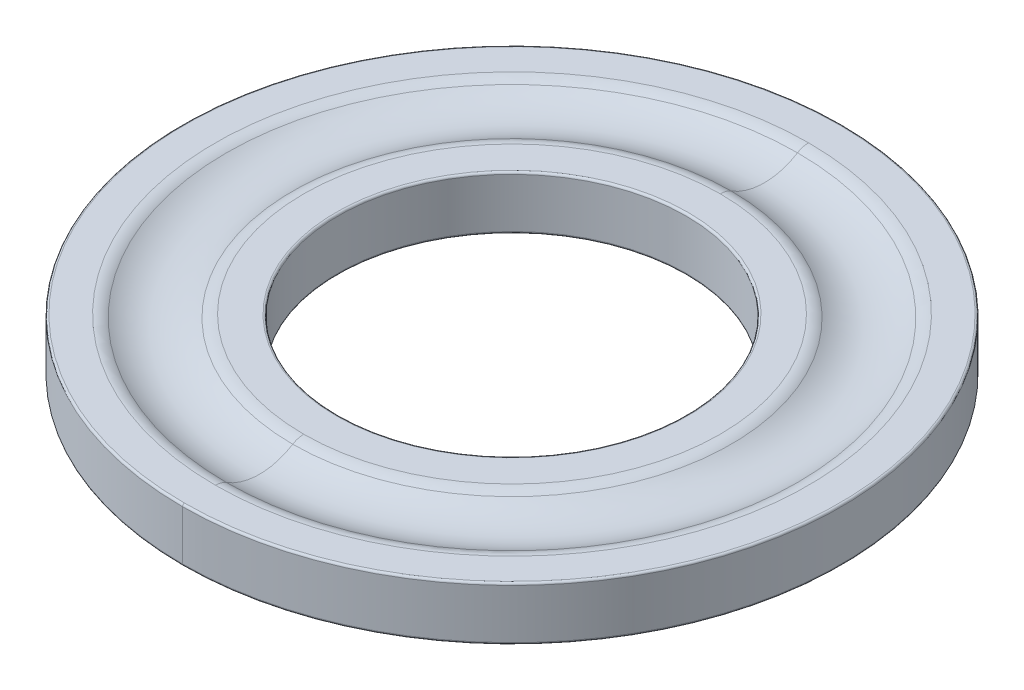
ISO-10303-21;
HEADER;
FILE_DESCRIPTION(('STEP AP214'),'2;1');
FILE_NAME('part.step','',(''),(''),'','','');
FILE_SCHEMA(('AUTOMOTIVE_DESIGN { 1 0 10303 214 1 1 1 1 }'));
ENDSEC;
DATA;
#1=APPLICATION_CONTEXT('core data for automotive mechanical design processes');
#2=APPLICATION_PROTOCOL_DEFINITION('international standard','automotive_design',2000,#1);
#3=PRODUCT_CONTEXT('',#1,'mechanical');
#4=PRODUCT('Part','Part','',(#3));
#5=PRODUCT_RELATED_PRODUCT_CATEGORY('part','',(#4));
#6=PRODUCT_DEFINITION_FORMATION('','',#4);
#7=PRODUCT_DEFINITION_CONTEXT('part definition',#1,'design');
#8=PRODUCT_DEFINITION('design','',#6,#7);
#9=PRODUCT_DEFINITION_SHAPE('','',#8);
#10=(LENGTH_UNIT() NAMED_UNIT(*) SI_UNIT(.MILLI.,.METRE.));
#11=(NAMED_UNIT(*) PLANE_ANGLE_UNIT() SI_UNIT($,.RADIAN.));
#12=(NAMED_UNIT(*) SI_UNIT($,.STERADIAN.) SOLID_ANGLE_UNIT());
#13=UNCERTAINTY_MEASURE_WITH_UNIT(LENGTH_MEASURE(1.E-05),#10,'distance_accuracy_value','');
#14=(GEOMETRIC_REPRESENTATION_CONTEXT(3) GLOBAL_UNCERTAINTY_ASSIGNED_CONTEXT((#13)) GLOBAL_UNIT_ASSIGNED_CONTEXT((#10,
#11,#12)) REPRESENTATION_CONTEXT('',''));
#15=CARTESIAN_POINT('',(0.,0.,0.));
#16=DIRECTION('',(0.,0.,1.));
#17=DIRECTION('',(1.,0.,0.));
#18=AXIS2_PLACEMENT_3D('',#15,#16,#17);
#19=CARTESIAN_POINT('',(0.,1.23,0.));
#20=DIRECTION('',(0.,1.,0.));
#21=DIRECTION('',(0.,0.,1.));
#22=AXIS2_PLACEMENT_3D('',#19,#20,#21);
#23=TOROIDAL_SURFACE('',#22,7.81,0.05);
#24=CARTESIAN_POINT('',(0.,1.23,-7.81));
#25=DIRECTION('',(1.,0.,0.));
#26=DIRECTION('',(0.,0.,-1.));
#27=AXIS2_PLACEMENT_3D('',#24,#25,#26);
#28=CIRCLE('',#27,0.05);
#29=CARTESIAN_POINT('',(0.,1.23,-7.86));
#30=VERTEX_POINT('',#29);
#31=CARTESIAN_POINT('',(0.,1.28,-7.81));
#32=VERTEX_POINT('',#31);
#33=EDGE_CURVE('E158',#30,#32,#28,.T.);
#34=ORIENTED_EDGE('',*,*,#33,.F.);
#35=CARTESIAN_POINT('',(0.,1.23,0.));
#36=DIRECTION('',(0.,-1.,0.));
#37=DIRECTION('',(0.,0.,1.));
#38=AXIS2_PLACEMENT_3D('',#35,#36,#37);
#39=CIRCLE('',#38,7.86);
#40=CARTESIAN_POINT('',(0.,1.23,7.86));
#41=VERTEX_POINT('',#40);
#42=EDGE_CURVE('E131',#41,#30,#39,.T.);
#43=ORIENTED_EDGE('',*,*,#42,.F.);
#44=CARTESIAN_POINT('',(0.,1.23,7.81));
#45=DIRECTION('',(-1.,0.,0.));
#46=DIRECTION('',(0.,0.,1.));
#47=AXIS2_PLACEMENT_3D('',#44,#45,#46);
#48=CIRCLE('',#47,0.05);
#49=CARTESIAN_POINT('',(0.,1.28,7.81));
#50=VERTEX_POINT('',#49);
#51=EDGE_CURVE('E166',#41,#50,#48,.T.);
#52=ORIENTED_EDGE('',*,*,#51,.T.);
#53=CARTESIAN_POINT('',(0.,1.28,0.));
#54=DIRECTION('',(0.,1.,0.));
#55=DIRECTION('',(0.,0.,1.));
#56=AXIS2_PLACEMENT_3D('',#53,#54,#55);
#57=CIRCLE('',#56,7.81);
#58=EDGE_CURVE('E155',#32,#50,#57,.T.);
#59=ORIENTED_EDGE('',*,*,#58,.F.);
#60=EDGE_LOOP('',(#34,#43,#52,#59));
#61=FACE_BOUND('',#60,.T.);
#62=ADVANCED_FACE('F44',(#61),#23,.T.);
#63=CARTESIAN_POINT('',(0.,0.05,0.));
#64=DIRECTION('',(0.,1.,0.));
#65=DIRECTION('',(0.,0.,1.));
#66=AXIS2_PLACEMENT_3D('',#63,#64,#65);
#67=TOROIDAL_SURFACE('',#66,7.81,0.05);
#68=CARTESIAN_POINT('',(0.,0.05,-7.81));
#69=DIRECTION('',(1.,0.,0.));
#70=DIRECTION('',(0.,0.,-1.));
#71=AXIS2_PLACEMENT_3D('',#68,#69,#70);
#72=CIRCLE('',#71,0.05);
#73=CARTESIAN_POINT('',(0.,0.,-7.81));
#74=VERTEX_POINT('',#73);
#75=CARTESIAN_POINT('',(0.,0.05,-7.86));
#76=VERTEX_POINT('',#75);
#77=EDGE_CURVE('E183',#74,#76,#72,.T.);
#78=ORIENTED_EDGE('',*,*,#77,.F.);
#79=CARTESIAN_POINT('',(0.,0.,0.));
#80=DIRECTION('',(0.,-1.,0.));
#81=DIRECTION('',(0.,0.,1.));
#82=AXIS2_PLACEMENT_3D('',#79,#80,#81);
#83=CIRCLE('',#82,7.81);
#84=CARTESIAN_POINT('',(0.,0.,7.81));
#85=VERTEX_POINT('',#84);
#86=EDGE_CURVE('E144',#85,#74,#83,.T.);
#87=ORIENTED_EDGE('',*,*,#86,.F.);
#88=CARTESIAN_POINT('',(0.,0.05,7.81));
#89=DIRECTION('',(-1.,0.,0.));
#90=DIRECTION('',(0.,0.,1.));
#91=AXIS2_PLACEMENT_3D('',#88,#89,#90);
#92=CIRCLE('',#91,0.05);
#93=CARTESIAN_POINT('',(0.,0.05,7.86));
#94=VERTEX_POINT('',#93);
#95=EDGE_CURVE('E174',#85,#94,#92,.T.);
#96=ORIENTED_EDGE('',*,*,#95,.T.);
#97=CARTESIAN_POINT('',(0.,0.05,0.));
#98=DIRECTION('',(0.,1.,0.));
#99=DIRECTION('',(0.,0.,1.));
#100=AXIS2_PLACEMENT_3D('',#97,#98,#99);
#101=CIRCLE('',#100,7.86);
#102=EDGE_CURVE('E143',#76,#94,#101,.T.);
#103=ORIENTED_EDGE('',*,*,#102,.F.);
#104=EDGE_LOOP('',(#78,#87,#96,#103));
#105=FACE_BOUND('',#104,.T.);
#106=ADVANCED_FACE('F291',(#105),#67,.T.);
#107=CARTESIAN_POINT('',(0.,0.78,0.));
#108=DIRECTION('',(0.,1.,0.));
#109=DIRECTION('',(0.,0.,1.));
#110=AXIS2_PLACEMENT_3D('',#107,#108,#109);
#111=TOROIDAL_SURFACE('',#110,7.07356537528527,0.5);
#112=CARTESIAN_POINT('',(0.,0.78,-7.07356537528527));
#113=DIRECTION('',(1.,0.,0.));
#114=DIRECTION('',(0.,0.,-1.));
#115=AXIS2_PLACEMENT_3D('',#112,#113,#114);
#116=CIRCLE('',#115,0.5);
#117=CARTESIAN_POINT('',(0.,1.28,-7.07356537528527));
#118=VERTEX_POINT('',#117);
#119=CARTESIAN_POINT('',(0.,1.205,-6.81017403146395));
#120=VERTEX_POINT('',#119);
#121=EDGE_CURVE('E195',#118,#120,#116,.T.);
#122=ORIENTED_EDGE('',*,*,#121,.F.);
#123=CARTESIAN_POINT('',(0.,1.28,0.));
#124=DIRECTION('',(0.,-1.,0.));
#125=DIRECTION('',(0.,0.,1.));
#126=AXIS2_PLACEMENT_3D('',#123,#124,#125);
#127=CIRCLE('',#126,7.07356537528527);
#128=CARTESIAN_POINT('',(0.,1.28,7.07356537528527));
#129=VERTEX_POINT('',#128);
#130=EDGE_CURVE('E188',#129,#118,#127,.T.);
#131=ORIENTED_EDGE('',*,*,#130,.F.);
#132=CARTESIAN_POINT('',(0.,0.78,7.07356537528527));
#133=DIRECTION('',(-1.,0.,0.));
#134=DIRECTION('',(0.,0.,1.));
#135=AXIS2_PLACEMENT_3D('',#132,#133,#134);
#136=CIRCLE('',#135,0.5);
#137=CARTESIAN_POINT('',(0.,1.205,6.81017403146395));
#138=VERTEX_POINT('',#137);
#139=EDGE_CURVE('E211',#129,#138,#136,.T.);
#140=ORIENTED_EDGE('',*,*,#139,.T.);
#141=CARTESIAN_POINT('',(0.,1.205,0.));
#142=DIRECTION('',(0.,1.,0.));
#143=DIRECTION('',(0.,0.,1.));
#144=AXIS2_PLACEMENT_3D('',#141,#142,#143);
#145=CIRCLE('',#144,6.81017403146395);
#146=EDGE_CURVE('E176',#120,#138,#145,.T.);
#147=ORIENTED_EDGE('',*,*,#146,.F.);
#148=EDGE_LOOP('',(#122,#131,#140,#147));
#149=FACE_BOUND('',#148,.T.);
#150=ADVANCED_FACE('F277',(#149),#111,.T.);
#151=CARTESIAN_POINT('',(0.,0.78,0.));
#152=DIRECTION('',(0.,-1.,0.));
#153=DIRECTION('',(0.,0.,-1.));
#154=AXIS2_PLACEMENT_3D('',#151,#152,#153);
#155=TOROIDAL_SURFACE('',#154,4.96643462471473,0.5);
#156=CARTESIAN_POINT('',(0.,0.78,4.96643462471473));
#157=DIRECTION('',(1.,0.,0.));
#158=DIRECTION('',(0.,0.,-1.));
#159=AXIS2_PLACEMENT_3D('',#156,#157,#158);
#160=CIRCLE('',#159,0.5);
#161=CARTESIAN_POINT('',(0.,1.28,4.96643462471473));
#162=VERTEX_POINT('',#161);
#163=CARTESIAN_POINT('',(0.,1.205,5.22982596853605));
#164=VERTEX_POINT('',#163);
#165=EDGE_CURVE('E198',#162,#164,#160,.T.);
#166=ORIENTED_EDGE('',*,*,#165,.F.);
#167=CARTESIAN_POINT('',(0.,1.28,0.));
#168=DIRECTION('',(0.,1.,0.));
#169=DIRECTION('',(0.,0.,1.));
#170=AXIS2_PLACEMENT_3D('',#167,#168,#169);
#171=CIRCLE('',#170,4.96643462471473);
#172=CARTESIAN_POINT('',(0.,1.28,-4.96643462471473));
#173=VERTEX_POINT('',#172);
#174=EDGE_CURVE('E234',#173,#162,#171,.T.);
#175=ORIENTED_EDGE('',*,*,#174,.F.);
#176=CARTESIAN_POINT('',(0.,0.78,-4.96643462471473));
#177=DIRECTION('',(-1.,0.,0.));
#178=DIRECTION('',(0.,0.,1.));
#179=AXIS2_PLACEMENT_3D('',#176,#177,#178);
#180=CIRCLE('',#179,0.5);
#181=CARTESIAN_POINT('',(0.,1.205,-5.22982596853605));
#182=VERTEX_POINT('',#181);
#183=EDGE_CURVE('E175',#173,#182,#180,.T.);
#184=ORIENTED_EDGE('',*,*,#183,.T.);
#185=CARTESIAN_POINT('',(0.,1.205,0.));
#186=DIRECTION('',(0.,-1.,0.));
#187=DIRECTION('',(0.,0.,1.));
#188=AXIS2_PLACEMENT_3D('',#185,#186,#187);
#189=CIRCLE('',#188,5.22982596853605);
#190=EDGE_CURVE('E71',#164,#182,#189,.T.);
#191=ORIENTED_EDGE('',*,*,#190,.F.);
#192=EDGE_LOOP('',(#166,#175,#184,#191));
#193=FACE_BOUND('',#192,.T.);
#194=ADVANCED_FACE('F265',(#193),#155,.T.);
#195=CARTESIAN_POINT('',(0.,2.48,0.));
#196=DIRECTION('',(0.,-1.,0.));
#197=DIRECTION('',(0.,0.,-1.));
#198=AXIS2_PLACEMENT_3D('',#195,#196,#197);
#199=TOROIDAL_SURFACE('',#198,6.02,1.5);
#200=CARTESIAN_POINT('',(0.,2.48,6.02));
#201=DIRECTION('',(1.,0.,0.));
#202=DIRECTION('',(0.,0.,-1.));
#203=AXIS2_PLACEMENT_3D('',#200,#201,#202);
#204=CIRCLE('',#203,1.5);
#205=EDGE_CURVE('E223',#138,#164,#204,.T.);
#206=ORIENTED_EDGE('',*,*,#205,.F.);
#207=CARTESIAN_POINT('',(0.,1.205,0.));
#208=DIRECTION('',(0.,1.,0.));
#209=DIRECTION('',(0.,0.,1.));
#210=AXIS2_PLACEMENT_3D('',#207,#208,#209);
#211=CIRCLE('',#210,6.81017403146395);
#212=EDGE_CURVE('E208',#138,#120,#211,.T.);
#213=ORIENTED_EDGE('',*,*,#212,.T.);
#214=CARTESIAN_POINT('',(0.,2.48,-6.02));
#215=DIRECTION('',(-1.,0.,0.));
#216=DIRECTION('',(0.,0.,1.));
#217=AXIS2_PLACEMENT_3D('',#214,#215,#216);
#218=CIRCLE('',#217,1.5);
#219=EDGE_CURVE('E62',#120,#182,#218,.T.);
#220=ORIENTED_EDGE('',*,*,#219,.T.);
#221=CARTESIAN_POINT('',(0.,1.205,0.));
#222=DIRECTION('',(0.,-1.,0.));
#223=DIRECTION('',(0.,0.,1.));
#224=AXIS2_PLACEMENT_3D('',#221,#222,#223);
#225=CIRCLE('',#224,5.22982596853605);
#226=EDGE_CURVE('E177',#182,#164,#225,.T.);
#227=ORIENTED_EDGE('',*,*,#226,.T.);
#228=EDGE_LOOP('',(#206,#213,#220,#227));
#229=FACE_BOUND('',#228,.T.);
#230=ADVANCED_FACE('F269',(#229),#199,.F.);
#231=CARTESIAN_POINT('',(0.,1.28,0.));
#232=DIRECTION('',(0.,-1.,0.));
#233=DIRECTION('',(0.,0.,-1.));
#234=AXIS2_PLACEMENT_3D('',#231,#232,#233);
#235=CYLINDRICAL_SURFACE('',#234,7.86);
#236=DIRECTION('',(0.,-1.,0.));
#237=VECTOR('',#236,1.);
#238=CARTESIAN_POINT('',(0.,1.28,7.86));
#239=LINE('',#238,#237);
#240=EDGE_CURVE('E137',#41,#94,#239,.T.);
#241=ORIENTED_EDGE('',*,*,#240,.F.);
#242=ORIENTED_EDGE('',*,*,#42,.T.);
#243=DIRECTION('',(0.,-1.,0.));
#244=VECTOR('',#243,1.);
#245=CARTESIAN_POINT('',(0.,1.28,-7.86));
#246=LINE('',#245,#244);
#247=EDGE_CURVE('E134',#30,#76,#246,.T.);
#248=ORIENTED_EDGE('',*,*,#247,.T.);
#249=ORIENTED_EDGE('',*,*,#102,.T.);
#250=EDGE_LOOP('',(#241,#242,#248,#249));
#251=FACE_BOUND('',#250,.T.);
#252=ADVANCED_FACE('F133',(#251),#235,.T.);
#253=CARTESIAN_POINT('',(0.,0.,0.));
#254=DIRECTION('',(0.,1.,0.));
#255=DIRECTION('',(1.,0.,0.));
#256=AXIS2_PLACEMENT_3D('',#253,#254,#255);
#257=PLANE('',#256);
#258=CARTESIAN_POINT('',(0.,0.,0.));
#259=DIRECTION('',(0.,1.,0.));
#260=DIRECTION('',(0.,0.,1.));
#261=AXIS2_PLACEMENT_3D('',#258,#259,#260);
#262=CIRCLE('',#261,4.2);
#263=CARTESIAN_POINT('',(0.,0.,4.2));
#264=VERTEX_POINT('',#263);
#265=EDGE_CURVE('E11',#264,#264,#262,.T.);
#266=ORIENTED_EDGE('',*,*,#265,.T.);
#267=EDGE_LOOP('',(#266));
#268=FACE_BOUND('',#267,.T.);
#269=ORIENTED_EDGE('',*,*,#86,.T.);
#270=CARTESIAN_POINT('',(0.,0.,0.));
#271=DIRECTION('',(0.,-1.,0.));
#272=DIRECTION('',(0.,0.,1.));
#273=AXIS2_PLACEMENT_3D('',#270,#271,#272);
#274=CIRCLE('',#273,7.81);
#275=EDGE_CURVE('E179',#74,#85,#274,.T.);
#276=ORIENTED_EDGE('',*,*,#275,.T.);
#277=EDGE_LOOP('',(#269,#276));
#278=FACE_BOUND('',#277,.T.);
#279=ADVANCED_FACE('F261',(#268,#278),#257,.F.);
#280=CARTESIAN_POINT('',(0.,1.28,0.));
#281=DIRECTION('',(0.,1.,0.));
#282=DIRECTION('',(1.,0.,0.));
#283=AXIS2_PLACEMENT_3D('',#280,#281,#282);
#284=PLANE('',#283);
#285=CARTESIAN_POINT('',(0.,1.28,0.));
#286=DIRECTION('',(0.,1.,0.));
#287=DIRECTION('',(0.,0.,1.));
#288=AXIS2_PLACEMENT_3D('',#285,#286,#287);
#289=CIRCLE('',#288,4.2);
#290=CARTESIAN_POINT('',(0.,1.28,4.2));
#291=VERTEX_POINT('',#290);
#292=EDGE_CURVE('E241',#291,#291,#289,.F.);
#293=ORIENTED_EDGE('',*,*,#292,.T.);
#294=EDGE_LOOP('',(#293));
#295=FACE_BOUND('',#294,.T.);
#296=ORIENTED_EDGE('',*,*,#174,.T.);
#297=CARTESIAN_POINT('',(0.,1.28,0.));
#298=DIRECTION('',(0.,1.,0.));
#299=DIRECTION('',(0.,0.,1.));
#300=AXIS2_PLACEMENT_3D('',#297,#298,#299);
#301=CIRCLE('',#300,4.96643462471473);
#302=EDGE_CURVE('E202',#162,#173,#301,.T.);
#303=ORIENTED_EDGE('',*,*,#302,.T.);
#304=EDGE_LOOP('',(#296,#303));
#305=FACE_BOUND('',#304,.T.);
#306=ADVANCED_FACE('F257',(#295,#305),#284,.T.);
#307=CARTESIAN_POINT('',(0.,1.28,0.));
#308=DIRECTION('',(0.,1.,0.));
#309=DIRECTION('',(1.,0.,0.));
#310=AXIS2_PLACEMENT_3D('',#307,#308,#309);
#311=PLANE('',#310);
#312=ORIENTED_EDGE('',*,*,#130,.T.);
#313=CARTESIAN_POINT('',(0.,1.28,0.));
#314=DIRECTION('',(0.,-1.,0.));
#315=DIRECTION('',(0.,0.,1.));
#316=AXIS2_PLACEMENT_3D('',#313,#314,#315);
#317=CIRCLE('',#316,7.07356537528527);
#318=EDGE_CURVE('E191',#118,#129,#317,.T.);
#319=ORIENTED_EDGE('',*,*,#318,.T.);
#320=EDGE_LOOP('',(#312,#319));
#321=FACE_BOUND('',#320,.T.);
#322=CARTESIAN_POINT('',(0.,1.28,0.));
#323=DIRECTION('',(0.,1.,0.));
#324=DIRECTION('',(0.,0.,1.));
#325=AXIS2_PLACEMENT_3D('',#322,#323,#324);
#326=CIRCLE('',#325,7.81);
#327=EDGE_CURVE('E163',#50,#32,#326,.T.);
#328=ORIENTED_EDGE('',*,*,#327,.T.);
#329=ORIENTED_EDGE('',*,*,#58,.T.);
#330=EDGE_LOOP('',(#328,#329));
#331=FACE_BOUND('',#330,.T.);
#332=ADVANCED_FACE('F260',(#321,#331),#311,.T.);
#333=CARTESIAN_POINT('',(0.,1.28,0.));
#334=DIRECTION('',(0.,-1.,0.));
#335=DIRECTION('',(0.,0.,-1.));
#336=AXIS2_PLACEMENT_3D('',#333,#334,#335);
#337=CYLINDRICAL_SURFACE('',#336,7.86);
#338=CARTESIAN_POINT('',(0.,1.23,0.));
#339=DIRECTION('',(0.,-1.,0.));
#340=DIRECTION('',(0.,0.,1.));
#341=AXIS2_PLACEMENT_3D('',#338,#339,#340);
#342=CIRCLE('',#341,7.86);
#343=EDGE_CURVE('E150',#30,#41,#342,.T.);
#344=ORIENTED_EDGE('',*,*,#343,.T.);
#345=ORIENTED_EDGE('',*,*,#240,.T.);
#346=CARTESIAN_POINT('',(0.,0.05,0.));
#347=DIRECTION('',(0.,1.,0.));
#348=DIRECTION('',(0.,0.,1.));
#349=AXIS2_PLACEMENT_3D('',#346,#347,#348);
#350=CIRCLE('',#349,7.86);
#351=EDGE_CURVE('E152',#94,#76,#350,.T.);
#352=ORIENTED_EDGE('',*,*,#351,.T.);
#353=ORIENTED_EDGE('',*,*,#247,.F.);
#354=EDGE_LOOP('',(#344,#345,#352,#353));
#355=FACE_BOUND('',#354,.T.);
#356=ADVANCED_FACE('F148',(#355),#337,.T.);
#357=CARTESIAN_POINT('',(0.,2.48,0.));
#358=DIRECTION('',(0.,-1.,0.));
#359=DIRECTION('',(0.,0.,-1.));
#360=AXIS2_PLACEMENT_3D('',#357,#358,#359);
#361=TOROIDAL_SURFACE('',#360,6.02,1.5);
#362=ORIENTED_EDGE('',*,*,#146,.T.);
#363=ORIENTED_EDGE('',*,*,#205,.T.);
#364=ORIENTED_EDGE('',*,*,#190,.T.);
#365=ORIENTED_EDGE('',*,*,#219,.F.);
#366=EDGE_LOOP('',(#362,#363,#364,#365));
#367=FACE_BOUND('',#366,.T.);
#368=ADVANCED_FACE('F273',(#367),#361,.F.);
#369=CARTESIAN_POINT('',(0.,0.78,0.));
#370=DIRECTION('',(0.,-1.,0.));
#371=DIRECTION('',(0.,0.,-1.));
#372=AXIS2_PLACEMENT_3D('',#369,#370,#371);
#373=TOROIDAL_SURFACE('',#372,4.96643462471473,0.5);
#374=ORIENTED_EDGE('',*,*,#302,.F.);
#375=ORIENTED_EDGE('',*,*,#165,.T.);
#376=ORIENTED_EDGE('',*,*,#226,.F.);
#377=ORIENTED_EDGE('',*,*,#183,.F.);
#378=EDGE_LOOP('',(#374,#375,#376,#377));
#379=FACE_BOUND('',#378,.T.);
#380=ADVANCED_FACE('F268',(#379),#373,.T.);
#381=CARTESIAN_POINT('',(0.,0.78,0.));
#382=DIRECTION('',(0.,1.,0.));
#383=DIRECTION('',(0.,0.,1.));
#384=AXIS2_PLACEMENT_3D('',#381,#382,#383);
#385=TOROIDAL_SURFACE('',#384,7.07356537528527,0.5);
#386=ORIENTED_EDGE('',*,*,#318,.F.);
#387=ORIENTED_EDGE('',*,*,#121,.T.);
#388=ORIENTED_EDGE('',*,*,#212,.F.);
#389=ORIENTED_EDGE('',*,*,#139,.F.);
#390=EDGE_LOOP('',(#386,#387,#388,#389));
#391=FACE_BOUND('',#390,.T.);
#392=ADVANCED_FACE('F280',(#391),#385,.T.);
#393=CARTESIAN_POINT('',(0.,0.05,0.));
#394=DIRECTION('',(0.,1.,0.));
#395=DIRECTION('',(0.,0.,1.));
#396=AXIS2_PLACEMENT_3D('',#393,#394,#395);
#397=TOROIDAL_SURFACE('',#396,7.81,0.05);
#398=ORIENTED_EDGE('',*,*,#275,.F.);
#399=ORIENTED_EDGE('',*,*,#77,.T.);
#400=ORIENTED_EDGE('',*,*,#351,.F.);
#401=ORIENTED_EDGE('',*,*,#95,.F.);
#402=EDGE_LOOP('',(#398,#399,#400,#401));
#403=FACE_BOUND('',#402,.T.);
#404=ADVANCED_FACE('F316',(#403),#397,.T.);
#405=CARTESIAN_POINT('',(0.,1.23,0.));
#406=DIRECTION('',(0.,1.,0.));
#407=DIRECTION('',(0.,0.,1.));
#408=AXIS2_PLACEMENT_3D('',#405,#406,#407);
#409=TOROIDAL_SURFACE('',#408,7.81,0.05);
#410=ORIENTED_EDGE('',*,*,#343,.F.);
#411=ORIENTED_EDGE('',*,*,#33,.T.);
#412=ORIENTED_EDGE('',*,*,#327,.F.);
#413=ORIENTED_EDGE('',*,*,#51,.F.);
#414=EDGE_LOOP('',(#410,#411,#412,#413));
#415=FACE_BOUND('',#414,.T.);
#416=ADVANCED_FACE('F165',(#415),#409,.T.);
#417=CARTESIAN_POINT('',(0.,10.,0.));
#418=DIRECTION('',(0.,-1.,0.));
#419=DIRECTION('',(0.,0.,-1.));
#420=AXIS2_PLACEMENT_3D('',#417,#418,#419);
#421=CYLINDRICAL_SURFACE('',#420,4.15);
#422=CARTESIAN_POINT('',(0.,1.23,0.));
#423=DIRECTION('',(0.,1.,0.));
#424=DIRECTION('',(0.,0.,1.));
#425=AXIS2_PLACEMENT_3D('',#422,#423,#424);
#426=CIRCLE('',#425,4.15);
#427=CARTESIAN_POINT('',(0.,1.23,4.15));
#428=VERTEX_POINT('',#427);
#429=EDGE_CURVE('E52',#428,#428,#426,.T.);
#430=ORIENTED_EDGE('',*,*,#429,.T.);
#431=EDGE_LOOP('',(#430));
#432=FACE_BOUND('',#431,.T.);
#433=CARTESIAN_POINT('',(0.,0.0499999999999997,0.));
#434=DIRECTION('',(0.,1.,0.));
#435=DIRECTION('',(0.,0.,1.));
#436=AXIS2_PLACEMENT_3D('',#433,#434,#435);
#437=CIRCLE('',#436,4.15);
#438=CARTESIAN_POINT('',(0.,0.0499999999999997,4.15));
#439=VERTEX_POINT('',#438);
#440=EDGE_CURVE('E244',#439,#439,#437,.F.);
#441=ORIENTED_EDGE('',*,*,#440,.T.);
#442=EDGE_LOOP('',(#441));
#443=FACE_BOUND('',#442,.T.);
#444=ADVANCED_FACE('F249',(#432,#443),#421,.F.);
#445=CARTESIAN_POINT('',(0.,1.23,0.));
#446=DIRECTION('',(0.,1.,0.));
#447=DIRECTION('',(0.,0.,1.));
#448=AXIS2_PLACEMENT_3D('',#445,#446,#447);
#449=TOROIDAL_SURFACE('',#448,4.2,0.05);
#450=ORIENTED_EDGE('',*,*,#429,.F.);
#451=EDGE_LOOP('',(#450));
#452=FACE_BOUND('',#451,.T.);
#453=ORIENTED_EDGE('',*,*,#292,.F.);
#454=EDGE_LOOP('',(#453));
#455=FACE_BOUND('',#454,.T.);
#456=ADVANCED_FACE('F252',(#452,#455),#449,.T.);
#457=CARTESIAN_POINT('',(0.,0.0499999999999997,0.));
#458=DIRECTION('',(0.,1.,0.));
#459=DIRECTION('',(0.,0.,1.));
#460=AXIS2_PLACEMENT_3D('',#457,#458,#459);
#461=TOROIDAL_SURFACE('',#460,4.2,0.05);
#462=ORIENTED_EDGE('',*,*,#440,.F.);
#463=EDGE_LOOP('',(#462));
#464=FACE_BOUND('',#463,.T.);
#465=ORIENTED_EDGE('',*,*,#265,.F.);
#466=EDGE_LOOP('',(#465));
#467=FACE_BOUND('',#466,.T.);
#468=ADVANCED_FACE('F46',(#464,#467),#461,.T.);
#469=CLOSED_SHELL('',(#62,#106,#150,#194,#230,#252,#279,#306,#332,#356,#368,#380,#392,#404,#416,
#444,#456,#468));
#470=MANIFOLD_SOLID_BREP('B2',#469);
#471=ADVANCED_BREP_SHAPE_REPRESENTATION('',(#18,#470),#14);
#472=SHAPE_DEFINITION_REPRESENTATION(#9,#471);
ENDSEC;
END-ISO-10303-21;
